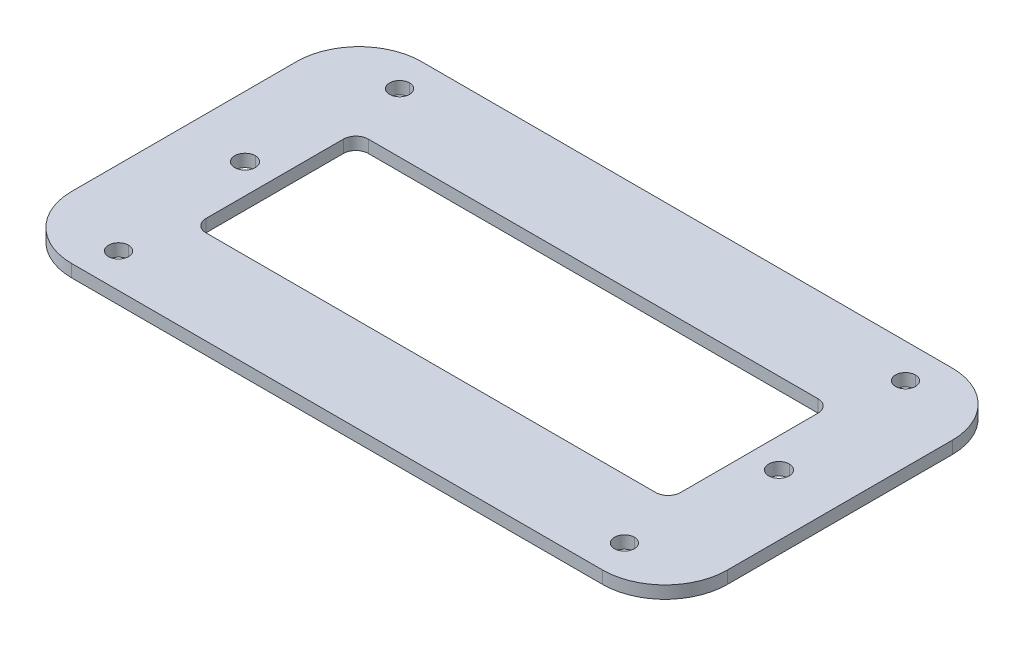
ISO-10303-21;
HEADER;
FILE_DESCRIPTION(('STEP AP214'),'2;1');
FILE_NAME('part.step','',(''),(''),'','','');
FILE_SCHEMA(('AUTOMOTIVE_DESIGN { 1 0 10303 214 1 1 1 1 }'));
ENDSEC;
DATA;
#1=APPLICATION_CONTEXT('core data for automotive mechanical design processes');
#2=APPLICATION_PROTOCOL_DEFINITION('international standard','automotive_design',2000,#1);
#3=PRODUCT_CONTEXT('',#1,'mechanical');
#4=PRODUCT('Part','Part','',(#3));
#5=PRODUCT_RELATED_PRODUCT_CATEGORY('part','',(#4));
#6=PRODUCT_DEFINITION_FORMATION('','',#4);
#7=PRODUCT_DEFINITION_CONTEXT('part definition',#1,'design');
#8=PRODUCT_DEFINITION('design','',#6,#7);
#9=PRODUCT_DEFINITION_SHAPE('','',#8);
#10=(LENGTH_UNIT() NAMED_UNIT(*) SI_UNIT(.MILLI.,.METRE.));
#11=(NAMED_UNIT(*) PLANE_ANGLE_UNIT() SI_UNIT($,.RADIAN.));
#12=(NAMED_UNIT(*) SI_UNIT($,.STERADIAN.) SOLID_ANGLE_UNIT());
#13=UNCERTAINTY_MEASURE_WITH_UNIT(LENGTH_MEASURE(1.E-05),#10,'distance_accuracy_value','');
#14=(GEOMETRIC_REPRESENTATION_CONTEXT(3) GLOBAL_UNCERTAINTY_ASSIGNED_CONTEXT((#13)) GLOBAL_UNIT_ASSIGNED_CONTEXT((#10,
#11,#12)) REPRESENTATION_CONTEXT('',''));
#15=CARTESIAN_POINT('',(0.,0.,0.));
#16=DIRECTION('',(0.,0.,1.));
#17=DIRECTION('',(1.,0.,0.));
#18=AXIS2_PLACEMENT_3D('',#15,#16,#17);
#19=CARTESIAN_POINT('',(-42.5,2.,18.));
#20=DIRECTION('',(0.,-1.,0.));
#21=DIRECTION('',(0.,0.,-1.));
#22=AXIS2_PLACEMENT_3D('',#19,#20,#21);
#23=CYLINDRICAL_SURFACE('',#22,10.);
#24=CARTESIAN_POINT('',(-42.5,2.,18.));
#25=DIRECTION('',(0.,1.,0.));
#26=DIRECTION('',(0.,0.,1.));
#27=AXIS2_PLACEMENT_3D('',#24,#25,#26);
#28=CIRCLE('',#27,10.);
#29=CARTESIAN_POINT('',(-52.5,2.,18.));
#30=VERTEX_POINT('',#29);
#31=CARTESIAN_POINT('',(-42.5,2.,28.));
#32=VERTEX_POINT('',#31);
#33=EDGE_CURVE('E255',#30,#32,#28,.T.);
#34=ORIENTED_EDGE('',*,*,#33,.F.);
#35=DIRECTION('',(0.,1.,0.));
#36=VECTOR('',#35,1.);
#37=CARTESIAN_POINT('',(-52.5,2.,18.));
#38=LINE('',#37,#36);
#39=CARTESIAN_POINT('',(-52.5,0.,18.));
#40=VERTEX_POINT('',#39);
#41=EDGE_CURVE('E254',#40,#30,#38,.T.);
#42=ORIENTED_EDGE('',*,*,#41,.F.);
#43=CARTESIAN_POINT('',(-42.5,0.,18.));
#44=DIRECTION('',(0.,-1.,0.));
#45=DIRECTION('',(0.,0.,1.));
#46=AXIS2_PLACEMENT_3D('',#43,#44,#45);
#47=CIRCLE('',#46,10.);
#48=CARTESIAN_POINT('',(-42.5,0.,28.));
#49=VERTEX_POINT('',#48);
#50=EDGE_CURVE('E237',#49,#40,#47,.T.);
#51=ORIENTED_EDGE('',*,*,#50,.F.);
#52=DIRECTION('',(0.,-1.,0.));
#53=VECTOR('',#52,1.);
#54=CARTESIAN_POINT('',(-42.5,2.,28.));
#55=LINE('',#54,#53);
#56=EDGE_CURVE('E368',#32,#49,#55,.T.);
#57=ORIENTED_EDGE('',*,*,#56,.F.);
#58=EDGE_LOOP('',(#34,#42,#51,#57));
#59=FACE_BOUND('',#58,.T.);
#60=ADVANCED_FACE('F15',(#59),#23,.T.);
#61=CARTESIAN_POINT('',(-42.5,2.,-18.));
#62=DIRECTION('',(0.,-1.,0.));
#63=DIRECTION('',(0.,0.,-1.));
#64=AXIS2_PLACEMENT_3D('',#61,#62,#63);
#65=CYLINDRICAL_SURFACE('',#64,10.);
#66=CARTESIAN_POINT('',(-42.5,2.,-18.));
#67=DIRECTION('',(0.,1.,0.));
#68=DIRECTION('',(0.,0.,1.));
#69=AXIS2_PLACEMENT_3D('',#66,#67,#68);
#70=CIRCLE('',#69,10.);
#71=CARTESIAN_POINT('',(-42.5,2.,-28.));
#72=VERTEX_POINT('',#71);
#73=CARTESIAN_POINT('',(-52.5,2.,-18.));
#74=VERTEX_POINT('',#73);
#75=EDGE_CURVE('E120',#72,#74,#70,.T.);
#76=ORIENTED_EDGE('',*,*,#75,.F.);
#77=DIRECTION('',(0.,1.,0.));
#78=VECTOR('',#77,1.);
#79=CARTESIAN_POINT('',(-42.5,2.,-28.));
#80=LINE('',#79,#78);
#81=CARTESIAN_POINT('',(-42.5,0.,-28.));
#82=VERTEX_POINT('',#81);
#83=EDGE_CURVE('E328',#82,#72,#80,.T.);
#84=ORIENTED_EDGE('',*,*,#83,.F.);
#85=CARTESIAN_POINT('',(-42.5,0.,-18.));
#86=DIRECTION('',(0.,-1.,0.));
#87=DIRECTION('',(0.,0.,1.));
#88=AXIS2_PLACEMENT_3D('',#85,#86,#87);
#89=CIRCLE('',#88,10.);
#90=CARTESIAN_POINT('',(-52.5,0.,-18.));
#91=VERTEX_POINT('',#90);
#92=EDGE_CURVE('E26',#91,#82,#89,.T.);
#93=ORIENTED_EDGE('',*,*,#92,.F.);
#94=DIRECTION('',(0.,-1.,0.));
#95=VECTOR('',#94,1.);
#96=CARTESIAN_POINT('',(-52.5,2.,-18.));
#97=LINE('',#96,#95);
#98=EDGE_CURVE('E262',#74,#91,#97,.T.);
#99=ORIENTED_EDGE('',*,*,#98,.F.);
#100=EDGE_LOOP('',(#76,#84,#93,#99));
#101=FACE_BOUND('',#100,.T.);
#102=ADVANCED_FACE('F568',(#101),#65,.T.);
#103=CARTESIAN_POINT('',(42.5,2.,-18.));
#104=DIRECTION('',(0.,1.,0.));
#105=DIRECTION('',(0.,0.,1.));
#106=AXIS2_PLACEMENT_3D('',#103,#104,#105);
#107=CYLINDRICAL_SURFACE('',#106,10.);
#108=CARTESIAN_POINT('',(42.5,2.,-18.));
#109=DIRECTION('',(0.,1.,0.));
#110=DIRECTION('',(0.,0.,1.));
#111=AXIS2_PLACEMENT_3D('',#108,#109,#110);
#112=CIRCLE('',#111,10.);
#113=CARTESIAN_POINT('',(52.5,2.,-18.));
#114=VERTEX_POINT('',#113);
#115=CARTESIAN_POINT('',(42.5,2.,-28.));
#116=VERTEX_POINT('',#115);
#117=EDGE_CURVE('E108',#114,#116,#112,.T.);
#118=ORIENTED_EDGE('',*,*,#117,.F.);
#119=DIRECTION('',(0.,1.,0.));
#120=VECTOR('',#119,1.);
#121=CARTESIAN_POINT('',(52.5,2.,-18.));
#122=LINE('',#121,#120);
#123=CARTESIAN_POINT('',(52.5,0.,-18.));
#124=VERTEX_POINT('',#123);
#125=EDGE_CURVE('E366',#124,#114,#122,.T.);
#126=ORIENTED_EDGE('',*,*,#125,.F.);
#127=CARTESIAN_POINT('',(42.5,0.,-18.));
#128=DIRECTION('',(0.,-1.,0.));
#129=DIRECTION('',(0.,0.,1.));
#130=AXIS2_PLACEMENT_3D('',#127,#128,#129);
#131=CIRCLE('',#130,10.);
#132=CARTESIAN_POINT('',(42.5,0.,-28.));
#133=VERTEX_POINT('',#132);
#134=EDGE_CURVE('E10',#133,#124,#131,.T.);
#135=ORIENTED_EDGE('',*,*,#134,.F.);
#136=DIRECTION('',(0.,-1.,0.));
#137=VECTOR('',#136,1.);
#138=CARTESIAN_POINT('',(42.5,0.,-28.));
#139=LINE('',#138,#137);
#140=EDGE_CURVE('E345',#116,#133,#139,.T.);
#141=ORIENTED_EDGE('',*,*,#140,.F.);
#142=EDGE_LOOP('',(#118,#126,#135,#141));
#143=FACE_BOUND('',#142,.T.);
#144=ADVANCED_FACE('F573',(#143),#107,.T.);
#145=CARTESIAN_POINT('',(42.5,2.,18.));
#146=DIRECTION('',(0.,1.,0.));
#147=DIRECTION('',(0.,0.,1.));
#148=AXIS2_PLACEMENT_3D('',#145,#146,#147);
#149=CYLINDRICAL_SURFACE('',#148,10.);
#150=CARTESIAN_POINT('',(42.5,2.,18.));
#151=DIRECTION('',(0.,1.,0.));
#152=DIRECTION('',(0.,0.,1.));
#153=AXIS2_PLACEMENT_3D('',#150,#151,#152);
#154=CIRCLE('',#153,10.);
#155=CARTESIAN_POINT('',(42.5,2.,28.));
#156=VERTEX_POINT('',#155);
#157=CARTESIAN_POINT('',(52.5,2.,18.));
#158=VERTEX_POINT('',#157);
#159=EDGE_CURVE('E336',#156,#158,#154,.T.);
#160=ORIENTED_EDGE('',*,*,#159,.F.);
#161=DIRECTION('',(0.,1.,0.));
#162=VECTOR('',#161,1.);
#163=CARTESIAN_POINT('',(42.5,2.,28.));
#164=LINE('',#163,#162);
#165=CARTESIAN_POINT('',(42.5,0.,28.));
#166=VERTEX_POINT('',#165);
#167=EDGE_CURVE('E418',#166,#156,#164,.T.);
#168=ORIENTED_EDGE('',*,*,#167,.F.);
#169=CARTESIAN_POINT('',(42.5,0.,18.));
#170=DIRECTION('',(0.,-1.,0.));
#171=DIRECTION('',(0.,0.,1.));
#172=AXIS2_PLACEMENT_3D('',#169,#170,#171);
#173=CIRCLE('',#172,10.);
#174=CARTESIAN_POINT('',(52.5,0.,18.));
#175=VERTEX_POINT('',#174);
#176=EDGE_CURVE('E251',#175,#166,#173,.T.);
#177=ORIENTED_EDGE('',*,*,#176,.F.);
#178=DIRECTION('',(0.,-1.,0.));
#179=VECTOR('',#178,1.);
#180=CARTESIAN_POINT('',(52.5,0.,18.));
#181=LINE('',#180,#179);
#182=EDGE_CURVE('E367',#158,#175,#181,.T.);
#183=ORIENTED_EDGE('',*,*,#182,.F.);
#184=EDGE_LOOP('',(#160,#168,#177,#183));
#185=FACE_BOUND('',#184,.T.);
#186=ADVANCED_FACE('F591',(#185),#149,.T.);
#187=CARTESIAN_POINT('',(0.,0.,0.));
#188=DIRECTION('',(0.,1.,0.));
#189=DIRECTION('',(1.,0.,0.));
#190=AXIS2_PLACEMENT_3D('',#187,#188,#189);
#191=PLANE('',#190);
#192=CARTESIAN_POINT('',(-42.75,0.,0.));
#193=DIRECTION('',(0.,1.,0.));
#194=DIRECTION('',(0.,0.,1.));
#195=AXIS2_PLACEMENT_3D('',#192,#193,#194);
#196=CIRCLE('',#195,1.65);
#197=CARTESIAN_POINT('',(-42.75,0.,-1.65));
#198=VERTEX_POINT('',#197);
#199=CARTESIAN_POINT('',(-42.75,0.,1.65));
#200=VERTEX_POINT('',#199);
#201=EDGE_CURVE('E349',#198,#200,#196,.T.);
#202=ORIENTED_EDGE('',*,*,#201,.T.);
#203=CARTESIAN_POINT('',(-42.75,0.,0.));
#204=DIRECTION('',(0.,1.,0.));
#205=DIRECTION('',(0.,0.,1.));
#206=AXIS2_PLACEMENT_3D('',#203,#204,#205);
#207=CIRCLE('',#206,1.65);
#208=EDGE_CURVE('E327',#200,#198,#207,.T.);
#209=ORIENTED_EDGE('',*,*,#208,.T.);
#210=EDGE_LOOP('',(#202,#209));
#211=FACE_BOUND('',#210,.T.);
#212=CARTESIAN_POINT('',(42.75,0.,0.));
#213=DIRECTION('',(0.,1.,0.));
#214=DIRECTION('',(0.,0.,1.));
#215=AXIS2_PLACEMENT_3D('',#212,#213,#214);
#216=CIRCLE('',#215,1.65);
#217=CARTESIAN_POINT('',(42.75,0.,-1.65));
#218=VERTEX_POINT('',#217);
#219=CARTESIAN_POINT('',(42.75,0.,1.65));
#220=VERTEX_POINT('',#219);
#221=EDGE_CURVE('E417',#218,#220,#216,.T.);
#222=ORIENTED_EDGE('',*,*,#221,.T.);
#223=CARTESIAN_POINT('',(42.75,0.,0.));
#224=DIRECTION('',(0.,1.,0.));
#225=DIRECTION('',(0.,0.,1.));
#226=AXIS2_PLACEMENT_3D('',#223,#224,#225);
#227=CIRCLE('',#226,1.65);
#228=EDGE_CURVE('E465',#220,#218,#227,.T.);
#229=ORIENTED_EDGE('',*,*,#228,.T.);
#230=EDGE_LOOP('',(#222,#229));
#231=FACE_BOUND('',#230,.T.);
#232=CARTESIAN_POINT('',(-40.5,0.,-22.5));
#233=DIRECTION('',(0.,1.,0.));
#234=DIRECTION('',(0.,0.,1.));
#235=AXIS2_PLACEMENT_3D('',#232,#233,#234);
#236=CIRCLE('',#235,1.6);
#237=CARTESIAN_POINT('',(-40.5,0.,-24.1));
#238=VERTEX_POINT('',#237);
#239=CARTESIAN_POINT('',(-40.5,0.,-20.9));
#240=VERTEX_POINT('',#239);
#241=EDGE_CURVE('E397',#238,#240,#236,.T.);
#242=ORIENTED_EDGE('',*,*,#241,.T.);
#243=CARTESIAN_POINT('',(-40.5,0.,-22.5));
#244=DIRECTION('',(0.,1.,0.));
#245=DIRECTION('',(0.,0.,1.));
#246=AXIS2_PLACEMENT_3D('',#243,#244,#245);
#247=CIRCLE('',#246,1.6);
#248=EDGE_CURVE('E280',#240,#238,#247,.T.);
#249=ORIENTED_EDGE('',*,*,#248,.T.);
#250=EDGE_LOOP('',(#242,#249));
#251=FACE_BOUND('',#250,.T.);
#252=CARTESIAN_POINT('',(-36.,0.,-11.));
#253=DIRECTION('',(0.,1.,0.));
#254=DIRECTION('',(0.,0.,1.));
#255=AXIS2_PLACEMENT_3D('',#252,#253,#254);
#256=CIRCLE('',#255,2.);
#257=CARTESIAN_POINT('',(-36.,0.,-13.));
#258=VERTEX_POINT('',#257);
#259=CARTESIAN_POINT('',(-38.,0.,-11.));
#260=VERTEX_POINT('',#259);
#261=EDGE_CURVE('E381',#258,#260,#256,.T.);
#262=ORIENTED_EDGE('',*,*,#261,.T.);
#263=DIRECTION('',(0.,0.,1.));
#264=VECTOR('',#263,1.);
#265=CARTESIAN_POINT('',(-38.,0.,0.));
#266=LINE('',#265,#264);
#267=CARTESIAN_POINT('',(-38.,0.,11.));
#268=VERTEX_POINT('',#267);
#269=EDGE_CURVE('E283',#260,#268,#266,.T.);
#270=ORIENTED_EDGE('',*,*,#269,.T.);
#271=CARTESIAN_POINT('',(-36.,0.,11.));
#272=DIRECTION('',(0.,1.,0.));
#273=DIRECTION('',(0.,0.,1.));
#274=AXIS2_PLACEMENT_3D('',#271,#272,#273);
#275=CIRCLE('',#274,2.);
#276=CARTESIAN_POINT('',(-36.,0.,13.));
#277=VERTEX_POINT('',#276);
#278=EDGE_CURVE('E438',#268,#277,#275,.T.);
#279=ORIENTED_EDGE('',*,*,#278,.T.);
#280=DIRECTION('',(1.,0.,0.));
#281=VECTOR('',#280,1.);
#282=CARTESIAN_POINT('',(0.,0.,13.));
#283=LINE('',#282,#281);
#284=CARTESIAN_POINT('',(36.,0.,13.));
#285=VERTEX_POINT('',#284);
#286=EDGE_CURVE('E387',#277,#285,#283,.T.);
#287=ORIENTED_EDGE('',*,*,#286,.T.);
#288=CARTESIAN_POINT('',(36.,0.,11.));
#289=DIRECTION('',(0.,1.,0.));
#290=DIRECTION('',(0.,0.,1.));
#291=AXIS2_PLACEMENT_3D('',#288,#289,#290);
#292=CIRCLE('',#291,2.);
#293=CARTESIAN_POINT('',(38.,0.,11.));
#294=VERTEX_POINT('',#293);
#295=EDGE_CURVE('E422',#285,#294,#292,.T.);
#296=ORIENTED_EDGE('',*,*,#295,.T.);
#297=DIRECTION('',(0.,0.,-1.));
#298=VECTOR('',#297,1.);
#299=CARTESIAN_POINT('',(38.,0.,0.));
#300=LINE('',#299,#298);
#301=CARTESIAN_POINT('',(38.,0.,-11.));
#302=VERTEX_POINT('',#301);
#303=EDGE_CURVE('E402',#294,#302,#300,.T.);
#304=ORIENTED_EDGE('',*,*,#303,.T.);
#305=CARTESIAN_POINT('',(36.,0.,-11.));
#306=DIRECTION('',(0.,1.,0.));
#307=DIRECTION('',(0.,0.,1.));
#308=AXIS2_PLACEMENT_3D('',#305,#306,#307);
#309=CIRCLE('',#308,2.);
#310=CARTESIAN_POINT('',(36.,0.,-13.));
#311=VERTEX_POINT('',#310);
#312=EDGE_CURVE('E289',#302,#311,#309,.T.);
#313=ORIENTED_EDGE('',*,*,#312,.T.);
#314=DIRECTION('',(-1.,0.,0.));
#315=VECTOR('',#314,1.);
#316=CARTESIAN_POINT('',(0.,0.,-13.));
#317=LINE('',#316,#315);
#318=EDGE_CURVE('E481',#311,#258,#317,.T.);
#319=ORIENTED_EDGE('',*,*,#318,.T.);
#320=EDGE_LOOP('',(#262,#270,#279,#287,#296,#304,#313,#319));
#321=FACE_BOUND('',#320,.T.);
#322=CARTESIAN_POINT('',(-40.5,0.,22.5));
#323=DIRECTION('',(0.,1.,0.));
#324=DIRECTION('',(0.,0.,1.));
#325=AXIS2_PLACEMENT_3D('',#322,#323,#324);
#326=CIRCLE('',#325,1.6);
#327=CARTESIAN_POINT('',(-40.5,0.,20.9));
#328=VERTEX_POINT('',#327);
#329=CARTESIAN_POINT('',(-40.5,0.,24.1));
#330=VERTEX_POINT('',#329);
#331=EDGE_CURVE('E293',#328,#330,#326,.T.);
#332=ORIENTED_EDGE('',*,*,#331,.T.);
#333=CARTESIAN_POINT('',(-40.5,0.,22.5));
#334=DIRECTION('',(0.,1.,0.));
#335=DIRECTION('',(0.,0.,1.));
#336=AXIS2_PLACEMENT_3D('',#333,#334,#335);
#337=CIRCLE('',#336,1.6);
#338=EDGE_CURVE('E432',#330,#328,#337,.T.);
#339=ORIENTED_EDGE('',*,*,#338,.T.);
#340=EDGE_LOOP('',(#332,#339));
#341=FACE_BOUND('',#340,.T.);
#342=CARTESIAN_POINT('',(40.5,0.,-22.5));
#343=DIRECTION('',(0.,1.,0.));
#344=DIRECTION('',(0.,0.,1.));
#345=AXIS2_PLACEMENT_3D('',#342,#343,#344);
#346=CIRCLE('',#345,1.6);
#347=CARTESIAN_POINT('',(40.5,0.,-24.1));
#348=VERTEX_POINT('',#347);
#349=CARTESIAN_POINT('',(40.5,0.,-20.9));
#350=VERTEX_POINT('',#349);
#351=EDGE_CURVE('E312',#348,#350,#346,.T.);
#352=ORIENTED_EDGE('',*,*,#351,.T.);
#353=CARTESIAN_POINT('',(40.5,0.,-22.5));
#354=DIRECTION('',(0.,1.,0.));
#355=DIRECTION('',(0.,0.,1.));
#356=AXIS2_PLACEMENT_3D('',#353,#354,#355);
#357=CIRCLE('',#356,1.6);
#358=EDGE_CURVE('E431',#350,#348,#357,.T.);
#359=ORIENTED_EDGE('',*,*,#358,.T.);
#360=EDGE_LOOP('',(#352,#359));
#361=FACE_BOUND('',#360,.T.);
#362=CARTESIAN_POINT('',(40.5,0.,22.5));
#363=DIRECTION('',(0.,1.,0.));
#364=DIRECTION('',(0.,0.,1.));
#365=AXIS2_PLACEMENT_3D('',#362,#363,#364);
#366=CIRCLE('',#365,1.6);
#367=CARTESIAN_POINT('',(40.5,0.,20.9));
#368=VERTEX_POINT('',#367);
#369=CARTESIAN_POINT('',(40.5,0.,24.1));
#370=VERTEX_POINT('',#369);
#371=EDGE_CURVE('E322',#368,#370,#366,.T.);
#372=ORIENTED_EDGE('',*,*,#371,.T.);
#373=CARTESIAN_POINT('',(40.5,0.,22.5));
#374=DIRECTION('',(0.,1.,0.));
#375=DIRECTION('',(0.,0.,1.));
#376=AXIS2_PLACEMENT_3D('',#373,#374,#375);
#377=CIRCLE('',#376,1.6);
#378=EDGE_CURVE('E275',#370,#368,#377,.T.);
#379=ORIENTED_EDGE('',*,*,#378,.T.);
#380=EDGE_LOOP('',(#372,#379));
#381=FACE_BOUND('',#380,.T.);
#382=DIRECTION('',(0.,0.,1.));
#383=VECTOR('',#382,1.);
#384=CARTESIAN_POINT('',(52.5,0.,0.));
#385=LINE('',#384,#383);
#386=EDGE_CURVE('E363',#124,#175,#385,.T.);
#387=ORIENTED_EDGE('',*,*,#386,.T.);
#388=ORIENTED_EDGE('',*,*,#176,.T.);
#389=DIRECTION('',(1.,0.,0.));
#390=VECTOR('',#389,1.);
#391=CARTESIAN_POINT('',(0.,0.,28.));
#392=LINE('',#391,#390);
#393=EDGE_CURVE('E246',#49,#166,#392,.T.);
#394=ORIENTED_EDGE('',*,*,#393,.F.);
#395=ORIENTED_EDGE('',*,*,#50,.T.);
#396=DIRECTION('',(0.,0.,1.));
#397=VECTOR('',#396,1.);
#398=CARTESIAN_POINT('',(-52.5,0.,0.));
#399=LINE('',#398,#397);
#400=EDGE_CURVE('E242',#91,#40,#399,.T.);
#401=ORIENTED_EDGE('',*,*,#400,.F.);
#402=ORIENTED_EDGE('',*,*,#92,.T.);
#403=DIRECTION('',(-1.,0.,0.));
#404=VECTOR('',#403,1.);
#405=CARTESIAN_POINT('',(0.,0.,-28.));
#406=LINE('',#405,#404);
#407=EDGE_CURVE('E338',#133,#82,#406,.T.);
#408=ORIENTED_EDGE('',*,*,#407,.F.);
#409=ORIENTED_EDGE('',*,*,#134,.T.);
#410=EDGE_LOOP('',(#387,#388,#394,#395,#401,#402,#408,#409));
#411=FACE_BOUND('',#410,.T.);
#412=ADVANCED_FACE('F240',(#211,#231,#251,#321,#341,#361,#381,#411),#191,.F.);
#413=CARTESIAN_POINT('',(0.,2.,0.));
#414=DIRECTION('',(0.,1.,0.));
#415=DIRECTION('',(1.,0.,0.));
#416=AXIS2_PLACEMENT_3D('',#413,#414,#415);
#417=PLANE('',#416);
#418=CARTESIAN_POINT('',(-42.75,2.,0.));
#419=DIRECTION('',(0.,1.,0.));
#420=DIRECTION('',(0.,0.,1.));
#421=AXIS2_PLACEMENT_3D('',#418,#419,#420);
#422=CIRCLE('',#421,1.65);
#423=CARTESIAN_POINT('',(-42.75,2.,-1.65));
#424=VERTEX_POINT('',#423);
#425=CARTESIAN_POINT('',(-42.75,2.,1.65));
#426=VERTEX_POINT('',#425);
#427=EDGE_CURVE('E451',#424,#426,#422,.T.);
#428=ORIENTED_EDGE('',*,*,#427,.F.);
#429=CARTESIAN_POINT('',(-42.75,2.,0.));
#430=DIRECTION('',(0.,1.,0.));
#431=DIRECTION('',(0.,0.,1.));
#432=AXIS2_PLACEMENT_3D('',#429,#430,#431);
#433=CIRCLE('',#432,1.65);
#434=EDGE_CURVE('E324',#426,#424,#433,.T.);
#435=ORIENTED_EDGE('',*,*,#434,.F.);
#436=EDGE_LOOP('',(#428,#435));
#437=FACE_BOUND('',#436,.T.);
#438=CARTESIAN_POINT('',(42.75,2.,0.));
#439=DIRECTION('',(0.,1.,0.));
#440=DIRECTION('',(0.,0.,1.));
#441=AXIS2_PLACEMENT_3D('',#438,#439,#440);
#442=CIRCLE('',#441,1.65);
#443=CARTESIAN_POINT('',(42.75,2.,-1.65));
#444=VERTEX_POINT('',#443);
#445=CARTESIAN_POINT('',(42.75,2.,1.65));
#446=VERTEX_POINT('',#445);
#447=EDGE_CURVE('E351',#444,#446,#442,.T.);
#448=ORIENTED_EDGE('',*,*,#447,.F.);
#449=CARTESIAN_POINT('',(42.75,2.,0.));
#450=DIRECTION('',(0.,1.,0.));
#451=DIRECTION('',(0.,0.,1.));
#452=AXIS2_PLACEMENT_3D('',#449,#450,#451);
#453=CIRCLE('',#452,1.65);
#454=EDGE_CURVE('E498',#446,#444,#453,.T.);
#455=ORIENTED_EDGE('',*,*,#454,.F.);
#456=EDGE_LOOP('',(#448,#455));
#457=FACE_BOUND('',#456,.T.);
#458=CARTESIAN_POINT('',(-40.5,2.,-22.5));
#459=DIRECTION('',(0.,1.,0.));
#460=DIRECTION('',(0.,0.,1.));
#461=AXIS2_PLACEMENT_3D('',#458,#459,#460);
#462=CIRCLE('',#461,1.6);
#463=CARTESIAN_POINT('',(-40.5,2.,-24.1));
#464=VERTEX_POINT('',#463);
#465=CARTESIAN_POINT('',(-40.5,2.,-20.9));
#466=VERTEX_POINT('',#465);
#467=EDGE_CURVE('E413',#464,#466,#462,.T.);
#468=ORIENTED_EDGE('',*,*,#467,.F.);
#469=CARTESIAN_POINT('',(-40.5,2.,-22.5));
#470=DIRECTION('',(0.,1.,0.));
#471=DIRECTION('',(0.,0.,1.));
#472=AXIS2_PLACEMENT_3D('',#469,#470,#471);
#473=CIRCLE('',#472,1.6);
#474=EDGE_CURVE('E284',#466,#464,#473,.T.);
#475=ORIENTED_EDGE('',*,*,#474,.F.);
#476=EDGE_LOOP('',(#468,#475));
#477=FACE_BOUND('',#476,.T.);
#478=CARTESIAN_POINT('',(-36.,2.,-11.));
#479=DIRECTION('',(0.,1.,0.));
#480=DIRECTION('',(0.,0.,1.));
#481=AXIS2_PLACEMENT_3D('',#478,#479,#480);
#482=CIRCLE('',#481,2.);
#483=CARTESIAN_POINT('',(-36.,2.,-13.));
#484=VERTEX_POINT('',#483);
#485=CARTESIAN_POINT('',(-38.,2.,-11.));
#486=VERTEX_POINT('',#485);
#487=EDGE_CURVE('E380',#484,#486,#482,.T.);
#488=ORIENTED_EDGE('',*,*,#487,.F.);
#489=DIRECTION('',(-1.,0.,0.));
#490=VECTOR('',#489,1.);
#491=CARTESIAN_POINT('',(0.,2.,-13.));
#492=LINE('',#491,#490);
#493=CARTESIAN_POINT('',(36.,2.,-13.));
#494=VERTEX_POINT('',#493);
#495=EDGE_CURVE('E459',#494,#484,#492,.T.);
#496=ORIENTED_EDGE('',*,*,#495,.F.);
#497=CARTESIAN_POINT('',(36.,2.,-11.));
#498=DIRECTION('',(0.,1.,0.));
#499=DIRECTION('',(0.,0.,1.));
#500=AXIS2_PLACEMENT_3D('',#497,#498,#499);
#501=CIRCLE('',#500,2.);
#502=CARTESIAN_POINT('',(38.,2.,-11.));
#503=VERTEX_POINT('',#502);
#504=EDGE_CURVE('E288',#503,#494,#501,.T.);
#505=ORIENTED_EDGE('',*,*,#504,.F.);
#506=DIRECTION('',(0.,0.,-1.));
#507=VECTOR('',#506,1.);
#508=CARTESIAN_POINT('',(38.,2.,0.));
#509=LINE('',#508,#507);
#510=CARTESIAN_POINT('',(38.,2.,11.));
#511=VERTEX_POINT('',#510);
#512=EDGE_CURVE('E426',#511,#503,#509,.T.);
#513=ORIENTED_EDGE('',*,*,#512,.F.);
#514=CARTESIAN_POINT('',(36.,2.,11.));
#515=DIRECTION('',(0.,1.,0.));
#516=DIRECTION('',(0.,0.,1.));
#517=AXIS2_PLACEMENT_3D('',#514,#515,#516);
#518=CIRCLE('',#517,2.);
#519=CARTESIAN_POINT('',(36.,2.,13.));
#520=VERTEX_POINT('',#519);
#521=EDGE_CURVE('E392',#520,#511,#518,.T.);
#522=ORIENTED_EDGE('',*,*,#521,.F.);
#523=DIRECTION('',(1.,0.,0.));
#524=VECTOR('',#523,1.);
#525=CARTESIAN_POINT('',(0.,2.,13.));
#526=LINE('',#525,#524);
#527=CARTESIAN_POINT('',(-36.,2.,13.));
#528=VERTEX_POINT('',#527);
#529=EDGE_CURVE('E435',#528,#520,#526,.T.);
#530=ORIENTED_EDGE('',*,*,#529,.F.);
#531=CARTESIAN_POINT('',(-36.,2.,11.));
#532=DIRECTION('',(0.,1.,0.));
#533=DIRECTION('',(0.,0.,1.));
#534=AXIS2_PLACEMENT_3D('',#531,#532,#533);
#535=CIRCLE('',#534,2.);
#536=CARTESIAN_POINT('',(-38.,2.,11.));
#537=VERTEX_POINT('',#536);
#538=EDGE_CURVE('E359',#537,#528,#535,.T.);
#539=ORIENTED_EDGE('',*,*,#538,.F.);
#540=DIRECTION('',(0.,0.,1.));
#541=VECTOR('',#540,1.);
#542=CARTESIAN_POINT('',(-38.,2.,0.));
#543=LINE('',#542,#541);
#544=EDGE_CURVE('E318',#486,#537,#543,.T.);
#545=ORIENTED_EDGE('',*,*,#544,.F.);
#546=EDGE_LOOP('',(#488,#496,#505,#513,#522,#530,#539,#545));
#547=FACE_BOUND('',#546,.T.);
#548=CARTESIAN_POINT('',(-40.5,2.,22.5));
#549=DIRECTION('',(0.,1.,0.));
#550=DIRECTION('',(0.,0.,1.));
#551=AXIS2_PLACEMENT_3D('',#548,#549,#550);
#552=CIRCLE('',#551,1.6);
#553=CARTESIAN_POINT('',(-40.5,2.,20.9));
#554=VERTEX_POINT('',#553);
#555=CARTESIAN_POINT('',(-40.5,2.,24.1));
#556=VERTEX_POINT('',#555);
#557=EDGE_CURVE('E294',#554,#556,#552,.T.);
#558=ORIENTED_EDGE('',*,*,#557,.F.);
#559=CARTESIAN_POINT('',(-40.5,2.,22.5));
#560=DIRECTION('',(0.,1.,0.));
#561=DIRECTION('',(0.,0.,1.));
#562=AXIS2_PLACEMENT_3D('',#559,#560,#561);
#563=CIRCLE('',#562,1.6);
#564=EDGE_CURVE('E485',#556,#554,#563,.T.);
#565=ORIENTED_EDGE('',*,*,#564,.F.);
#566=EDGE_LOOP('',(#558,#565));
#567=FACE_BOUND('',#566,.T.);
#568=CARTESIAN_POINT('',(40.5,2.,-22.5));
#569=DIRECTION('',(0.,1.,0.));
#570=DIRECTION('',(0.,0.,1.));
#571=AXIS2_PLACEMENT_3D('',#568,#569,#570);
#572=CIRCLE('',#571,1.6);
#573=CARTESIAN_POINT('',(40.5,2.,-24.1));
#574=VERTEX_POINT('',#573);
#575=CARTESIAN_POINT('',(40.5,2.,-20.9));
#576=VERTEX_POINT('',#575);
#577=EDGE_CURVE('E409',#574,#576,#572,.T.);
#578=ORIENTED_EDGE('',*,*,#577,.F.);
#579=CARTESIAN_POINT('',(40.5,2.,-22.5));
#580=DIRECTION('',(0.,1.,0.));
#581=DIRECTION('',(0.,0.,1.));
#582=AXIS2_PLACEMENT_3D('',#579,#580,#581);
#583=CIRCLE('',#582,1.6);
#584=EDGE_CURVE('E428',#576,#574,#583,.T.);
#585=ORIENTED_EDGE('',*,*,#584,.F.);
#586=EDGE_LOOP('',(#578,#585));
#587=FACE_BOUND('',#586,.T.);
#588=CARTESIAN_POINT('',(40.5,2.,22.5));
#589=DIRECTION('',(0.,1.,0.));
#590=DIRECTION('',(0.,0.,1.));
#591=AXIS2_PLACEMENT_3D('',#588,#589,#590);
#592=CIRCLE('',#591,1.6);
#593=CARTESIAN_POINT('',(40.5,2.,20.9));
#594=VERTEX_POINT('',#593);
#595=CARTESIAN_POINT('',(40.5,2.,24.1));
#596=VERTEX_POINT('',#595);
#597=EDGE_CURVE('E323',#594,#596,#592,.T.);
#598=ORIENTED_EDGE('',*,*,#597,.F.);
#599=CARTESIAN_POINT('',(40.5,2.,22.5));
#600=DIRECTION('',(0.,1.,0.));
#601=DIRECTION('',(0.,0.,1.));
#602=AXIS2_PLACEMENT_3D('',#599,#600,#601);
#603=CIRCLE('',#602,1.6);
#604=EDGE_CURVE('E279',#596,#594,#603,.T.);
#605=ORIENTED_EDGE('',*,*,#604,.F.);
#606=EDGE_LOOP('',(#598,#605));
#607=FACE_BOUND('',#606,.T.);
#608=DIRECTION('',(1.,0.,0.));
#609=VECTOR('',#608,1.);
#610=CARTESIAN_POINT('',(0.,2.,28.));
#611=LINE('',#610,#609);
#612=EDGE_CURVE('E372',#32,#156,#611,.T.);
#613=ORIENTED_EDGE('',*,*,#612,.T.);
#614=ORIENTED_EDGE('',*,*,#159,.T.);
#615=DIRECTION('',(0.,0.,1.));
#616=VECTOR('',#615,1.);
#617=CARTESIAN_POINT('',(52.5,2.,0.));
#618=LINE('',#617,#616);
#619=EDGE_CURVE('E371',#114,#158,#618,.T.);
#620=ORIENTED_EDGE('',*,*,#619,.F.);
#621=ORIENTED_EDGE('',*,*,#117,.T.);
#622=DIRECTION('',(-1.,0.,0.));
#623=VECTOR('',#622,1.);
#624=CARTESIAN_POINT('',(0.,2.,-28.));
#625=LINE('',#624,#623);
#626=EDGE_CURVE('E278',#116,#72,#625,.T.);
#627=ORIENTED_EDGE('',*,*,#626,.T.);
#628=ORIENTED_EDGE('',*,*,#75,.T.);
#629=DIRECTION('',(0.,0.,1.));
#630=VECTOR('',#629,1.);
#631=CARTESIAN_POINT('',(-52.5,2.,0.));
#632=LINE('',#631,#630);
#633=EDGE_CURVE('E268',#74,#30,#632,.T.);
#634=ORIENTED_EDGE('',*,*,#633,.T.);
#635=ORIENTED_EDGE('',*,*,#33,.T.);
#636=EDGE_LOOP('',(#613,#614,#620,#621,#627,#628,#634,#635));
#637=FACE_BOUND('',#636,.T.);
#638=ADVANCED_FACE('F590',(#437,#457,#477,#547,#567,#587,#607,#637),#417,.T.);
#639=CARTESIAN_POINT('',(-42.75,2.,0.));
#640=DIRECTION('',(0.,-1.,0.));
#641=DIRECTION('',(0.,0.,-1.));
#642=AXIS2_PLACEMENT_3D('',#639,#640,#641);
#643=CYLINDRICAL_SURFACE('',#642,1.65);
#644=DIRECTION('',(0.,-1.,0.));
#645=VECTOR('',#644,1.);
#646=CARTESIAN_POINT('',(-42.75,2.,1.65));
#647=LINE('',#646,#645);
#648=EDGE_CURVE('E455',#426,#200,#647,.T.);
#649=ORIENTED_EDGE('',*,*,#648,.F.);
#650=ORIENTED_EDGE('',*,*,#434,.T.);
#651=DIRECTION('',(0.,-1.,0.));
#652=VECTOR('',#651,1.);
#653=CARTESIAN_POINT('',(-42.75,2.,-1.65));
#654=LINE('',#653,#652);
#655=EDGE_CURVE('E376',#424,#198,#654,.T.);
#656=ORIENTED_EDGE('',*,*,#655,.T.);
#657=ORIENTED_EDGE('',*,*,#208,.F.);
#658=EDGE_LOOP('',(#649,#650,#656,#657));
#659=FACE_BOUND('',#658,.T.);
#660=ADVANCED_FACE('F577',(#659),#643,.F.);
#661=CARTESIAN_POINT('',(0.,2.,-28.));
#662=DIRECTION('',(0.,0.,1.));
#663=DIRECTION('',(1.,0.,0.));
#664=AXIS2_PLACEMENT_3D('',#661,#662,#663);
#665=PLANE('',#664);
#666=ORIENTED_EDGE('',*,*,#626,.F.);
#667=ORIENTED_EDGE('',*,*,#140,.T.);
#668=ORIENTED_EDGE('',*,*,#407,.T.);
#669=ORIENTED_EDGE('',*,*,#83,.T.);
#670=EDGE_LOOP('',(#666,#667,#668,#669));
#671=FACE_BOUND('',#670,.T.);
#672=ADVANCED_FACE('F634',(#671),#665,.F.);
#673=CARTESIAN_POINT('',(40.5,2.,22.5));
#674=DIRECTION('',(0.,-1.,0.));
#675=DIRECTION('',(0.,0.,-1.));
#676=AXIS2_PLACEMENT_3D('',#673,#674,#675);
#677=CYLINDRICAL_SURFACE('',#676,1.6);
#678=DIRECTION('',(0.,-1.,0.));
#679=VECTOR('',#678,1.);
#680=CARTESIAN_POINT('',(40.5,2.,24.1));
#681=LINE('',#680,#679);
#682=EDGE_CURVE('E319',#596,#370,#681,.T.);
#683=ORIENTED_EDGE('',*,*,#682,.F.);
#684=ORIENTED_EDGE('',*,*,#604,.T.);
#685=DIRECTION('',(0.,-1.,0.));
#686=VECTOR('',#685,1.);
#687=CARTESIAN_POINT('',(40.5,2.,20.9));
#688=LINE('',#687,#686);
#689=EDGE_CURVE('E396',#594,#368,#688,.T.);
#690=ORIENTED_EDGE('',*,*,#689,.T.);
#691=ORIENTED_EDGE('',*,*,#378,.F.);
#692=EDGE_LOOP('',(#683,#684,#690,#691));
#693=FACE_BOUND('',#692,.T.);
#694=ADVANCED_FACE('F636',(#693),#677,.F.);
#695=CARTESIAN_POINT('',(40.5,2.,-22.5));
#696=DIRECTION('',(0.,-1.,0.));
#697=DIRECTION('',(0.,0.,-1.));
#698=AXIS2_PLACEMENT_3D('',#695,#696,#697);
#699=CYLINDRICAL_SURFACE('',#698,1.6);
#700=DIRECTION('',(0.,-1.,0.));
#701=VECTOR('',#700,1.);
#702=CARTESIAN_POINT('',(40.5,2.,-20.9));
#703=LINE('',#702,#701);
#704=EDGE_CURVE('E471',#576,#350,#703,.T.);
#705=ORIENTED_EDGE('',*,*,#704,.F.);
#706=ORIENTED_EDGE('',*,*,#584,.T.);
#707=DIRECTION('',(0.,-1.,0.));
#708=VECTOR('',#707,1.);
#709=CARTESIAN_POINT('',(40.5,2.,-24.1));
#710=LINE('',#709,#708);
#711=EDGE_CURVE('E305',#574,#348,#710,.T.);
#712=ORIENTED_EDGE('',*,*,#711,.T.);
#713=ORIENTED_EDGE('',*,*,#358,.F.);
#714=EDGE_LOOP('',(#705,#706,#712,#713));
#715=FACE_BOUND('',#714,.T.);
#716=ADVANCED_FACE('F611',(#715),#699,.F.);
#717=CARTESIAN_POINT('',(-40.5,2.,22.5));
#718=DIRECTION('',(0.,-1.,0.));
#719=DIRECTION('',(0.,0.,-1.));
#720=AXIS2_PLACEMENT_3D('',#717,#718,#719);
#721=CYLINDRICAL_SURFACE('',#720,1.6);
#722=DIRECTION('',(0.,-1.,0.));
#723=VECTOR('',#722,1.);
#724=CARTESIAN_POINT('',(-40.5,2.,24.1));
#725=LINE('',#724,#723);
#726=EDGE_CURVE('E290',#556,#330,#725,.T.);
#727=ORIENTED_EDGE('',*,*,#726,.F.);
#728=ORIENTED_EDGE('',*,*,#564,.T.);
#729=DIRECTION('',(0.,-1.,0.));
#730=VECTOR('',#729,1.);
#731=CARTESIAN_POINT('',(-40.5,2.,20.9));
#732=LINE('',#731,#730);
#733=EDGE_CURVE('E303',#554,#328,#732,.T.);
#734=ORIENTED_EDGE('',*,*,#733,.T.);
#735=ORIENTED_EDGE('',*,*,#338,.F.);
#736=EDGE_LOOP('',(#727,#728,#734,#735));
#737=FACE_BOUND('',#736,.T.);
#738=ADVANCED_FACE('F551',(#737),#721,.F.);
#739=CARTESIAN_POINT('',(-38.,2.,0.));
#740=DIRECTION('',(1.,0.,0.));
#741=DIRECTION('',(0.,0.,1.));
#742=AXIS2_PLACEMENT_3D('',#739,#740,#741);
#743=PLANE('',#742);
#744=ORIENTED_EDGE('',*,*,#269,.F.);
#745=DIRECTION('',(0.,-1.,0.));
#746=VECTOR('',#745,1.);
#747=CARTESIAN_POINT('',(-38.,2.,-11.));
#748=LINE('',#747,#746);
#749=EDGE_CURVE('E477',#486,#260,#748,.T.);
#750=ORIENTED_EDGE('',*,*,#749,.F.);
#751=ORIENTED_EDGE('',*,*,#544,.T.);
#752=DIRECTION('',(0.,-1.,0.));
#753=VECTOR('',#752,1.);
#754=CARTESIAN_POINT('',(-38.,2.,11.));
#755=LINE('',#754,#753);
#756=EDGE_CURVE('E19',#537,#268,#755,.T.);
#757=ORIENTED_EDGE('',*,*,#756,.T.);
#758=EDGE_LOOP('',(#744,#750,#751,#757));
#759=FACE_BOUND('',#758,.T.);
#760=ADVANCED_FACE('F599',(#759),#743,.T.);
#761=CARTESIAN_POINT('',(-40.5,2.,-22.5));
#762=DIRECTION('',(0.,-1.,0.));
#763=DIRECTION('',(0.,0.,-1.));
#764=AXIS2_PLACEMENT_3D('',#761,#762,#763);
#765=CYLINDRICAL_SURFACE('',#764,1.6);
#766=DIRECTION('',(0.,-1.,0.));
#767=VECTOR('',#766,1.);
#768=CARTESIAN_POINT('',(-40.5,2.,-20.9));
#769=LINE('',#768,#767);
#770=EDGE_CURVE('E401',#466,#240,#769,.T.);
#771=ORIENTED_EDGE('',*,*,#770,.F.);
#772=ORIENTED_EDGE('',*,*,#474,.T.);
#773=DIRECTION('',(0.,-1.,0.));
#774=VECTOR('',#773,1.);
#775=CARTESIAN_POINT('',(-40.5,2.,-24.1));
#776=LINE('',#775,#774);
#777=EDGE_CURVE('E356',#464,#238,#776,.T.);
#778=ORIENTED_EDGE('',*,*,#777,.T.);
#779=ORIENTED_EDGE('',*,*,#248,.F.);
#780=EDGE_LOOP('',(#771,#772,#778,#779));
#781=FACE_BOUND('',#780,.T.);
#782=ADVANCED_FACE('F602',(#781),#765,.F.);
#783=CARTESIAN_POINT('',(42.75,2.,0.));
#784=DIRECTION('',(0.,-1.,0.));
#785=DIRECTION('',(0.,0.,-1.));
#786=AXIS2_PLACEMENT_3D('',#783,#784,#785);
#787=CYLINDRICAL_SURFACE('',#786,1.65);
#788=DIRECTION('',(0.,-1.,0.));
#789=VECTOR('',#788,1.);
#790=CARTESIAN_POINT('',(42.75,2.,1.65));
#791=LINE('',#790,#789);
#792=EDGE_CURVE('E355',#446,#220,#791,.T.);
#793=ORIENTED_EDGE('',*,*,#792,.F.);
#794=ORIENTED_EDGE('',*,*,#454,.T.);
#795=DIRECTION('',(0.,-1.,0.));
#796=VECTOR('',#795,1.);
#797=CARTESIAN_POINT('',(42.75,2.,-1.65));
#798=LINE('',#797,#796);
#799=EDGE_CURVE('E386',#444,#218,#798,.T.);
#800=ORIENTED_EDGE('',*,*,#799,.T.);
#801=ORIENTED_EDGE('',*,*,#228,.F.);
#802=EDGE_LOOP('',(#793,#794,#800,#801));
#803=FACE_BOUND('',#802,.T.);
#804=ADVANCED_FACE('F522',(#803),#787,.F.);
#805=CARTESIAN_POINT('',(52.5,2.,0.));
#806=DIRECTION('',(1.,0.,0.));
#807=DIRECTION('',(0.,1.,0.));
#808=AXIS2_PLACEMENT_3D('',#805,#806,#807);
#809=PLANE('',#808);
#810=ORIENTED_EDGE('',*,*,#619,.T.);
#811=ORIENTED_EDGE('',*,*,#182,.T.);
#812=ORIENTED_EDGE('',*,*,#386,.F.);
#813=ORIENTED_EDGE('',*,*,#125,.T.);
#814=EDGE_LOOP('',(#810,#811,#812,#813));
#815=FACE_BOUND('',#814,.T.);
#816=ADVANCED_FACE('F632',(#815),#809,.T.);
#817=CARTESIAN_POINT('',(0.,2.,28.));
#818=DIRECTION('',(0.,0.,-1.));
#819=DIRECTION('',(0.,-1.,0.));
#820=AXIS2_PLACEMENT_3D('',#817,#818,#819);
#821=PLANE('',#820);
#822=ORIENTED_EDGE('',*,*,#393,.T.);
#823=ORIENTED_EDGE('',*,*,#167,.T.);
#824=ORIENTED_EDGE('',*,*,#612,.F.);
#825=ORIENTED_EDGE('',*,*,#56,.T.);
#826=EDGE_LOOP('',(#822,#823,#824,#825));
#827=FACE_BOUND('',#826,.T.);
#828=ADVANCED_FACE('F618',(#827),#821,.F.);
#829=CARTESIAN_POINT('',(-52.5,2.,0.));
#830=DIRECTION('',(1.,0.,0.));
#831=DIRECTION('',(0.,0.,-1.));
#832=AXIS2_PLACEMENT_3D('',#829,#830,#831);
#833=PLANE('',#832);
#834=ORIENTED_EDGE('',*,*,#633,.F.);
#835=ORIENTED_EDGE('',*,*,#98,.T.);
#836=ORIENTED_EDGE('',*,*,#400,.T.);
#837=ORIENTED_EDGE('',*,*,#41,.T.);
#838=EDGE_LOOP('',(#834,#835,#836,#837));
#839=FACE_BOUND('',#838,.T.);
#840=ADVANCED_FACE('F261',(#839),#833,.F.);
#841=CARTESIAN_POINT('',(-36.,2.,11.));
#842=DIRECTION('',(0.,-1.,0.));
#843=DIRECTION('',(0.,0.,-1.));
#844=AXIS2_PLACEMENT_3D('',#841,#842,#843);
#845=CYLINDRICAL_SURFACE('',#844,2.);
#846=ORIENTED_EDGE('',*,*,#278,.F.);
#847=ORIENTED_EDGE('',*,*,#756,.F.);
#848=ORIENTED_EDGE('',*,*,#538,.T.);
#849=DIRECTION('',(0.,-1.,0.));
#850=VECTOR('',#849,1.);
#851=CARTESIAN_POINT('',(-36.,2.,13.));
#852=LINE('',#851,#850);
#853=EDGE_CURVE('E391',#528,#277,#852,.T.);
#854=ORIENTED_EDGE('',*,*,#853,.T.);
#855=EDGE_LOOP('',(#846,#847,#848,#854));
#856=FACE_BOUND('',#855,.T.);
#857=ADVANCED_FACE('F586',(#856),#845,.F.);
#858=CARTESIAN_POINT('',(0.,2.,13.));
#859=DIRECTION('',(0.,0.,-1.));
#860=DIRECTION('',(-1.,0.,0.));
#861=AXIS2_PLACEMENT_3D('',#858,#859,#860);
#862=PLANE('',#861);
#863=ORIENTED_EDGE('',*,*,#286,.F.);
#864=ORIENTED_EDGE('',*,*,#853,.F.);
#865=ORIENTED_EDGE('',*,*,#529,.T.);
#866=DIRECTION('',(0.,-1.,0.));
#867=VECTOR('',#866,1.);
#868=CARTESIAN_POINT('',(36.,2.,13.));
#869=LINE('',#868,#867);
#870=EDGE_CURVE('E425',#520,#285,#869,.T.);
#871=ORIENTED_EDGE('',*,*,#870,.T.);
#872=EDGE_LOOP('',(#863,#864,#865,#871));
#873=FACE_BOUND('',#872,.T.);
#874=ADVANCED_FACE('F582',(#873),#862,.T.);
#875=CARTESIAN_POINT('',(36.,2.,11.));
#876=DIRECTION('',(0.,-1.,0.));
#877=DIRECTION('',(0.,0.,-1.));
#878=AXIS2_PLACEMENT_3D('',#875,#876,#877);
#879=CYLINDRICAL_SURFACE('',#878,2.);
#880=ORIENTED_EDGE('',*,*,#295,.F.);
#881=ORIENTED_EDGE('',*,*,#870,.F.);
#882=ORIENTED_EDGE('',*,*,#521,.T.);
#883=DIRECTION('',(0.,-1.,0.));
#884=VECTOR('',#883,1.);
#885=CARTESIAN_POINT('',(38.,2.,11.));
#886=LINE('',#885,#884);
#887=EDGE_CURVE('E405',#511,#294,#886,.T.);
#888=ORIENTED_EDGE('',*,*,#887,.T.);
#889=EDGE_LOOP('',(#880,#881,#882,#888));
#890=FACE_BOUND('',#889,.T.);
#891=ADVANCED_FACE('F578',(#890),#879,.F.);
#892=CARTESIAN_POINT('',(38.,2.,0.));
#893=DIRECTION('',(-1.,0.,0.));
#894=DIRECTION('',(0.,0.,1.));
#895=AXIS2_PLACEMENT_3D('',#892,#893,#894);
#896=PLANE('',#895);
#897=ORIENTED_EDGE('',*,*,#303,.F.);
#898=ORIENTED_EDGE('',*,*,#887,.F.);
#899=ORIENTED_EDGE('',*,*,#512,.T.);
#900=DIRECTION('',(0.,-1.,0.));
#901=VECTOR('',#900,1.);
#902=CARTESIAN_POINT('',(38.,2.,-11.));
#903=LINE('',#902,#901);
#904=EDGE_CURVE('E285',#503,#302,#903,.T.);
#905=ORIENTED_EDGE('',*,*,#904,.T.);
#906=EDGE_LOOP('',(#897,#898,#899,#905));
#907=FACE_BOUND('',#906,.T.);
#908=ADVANCED_FACE('F581',(#907),#896,.T.);
#909=CARTESIAN_POINT('',(36.,2.,-11.));
#910=DIRECTION('',(0.,-1.,0.));
#911=DIRECTION('',(0.,0.,-1.));
#912=AXIS2_PLACEMENT_3D('',#909,#910,#911);
#913=CYLINDRICAL_SURFACE('',#912,2.);
#914=ORIENTED_EDGE('',*,*,#312,.F.);
#915=ORIENTED_EDGE('',*,*,#904,.F.);
#916=ORIENTED_EDGE('',*,*,#504,.T.);
#917=DIRECTION('',(0.,-1.,0.));
#918=VECTOR('',#917,1.);
#919=CARTESIAN_POINT('',(36.,2.,-13.));
#920=LINE('',#919,#918);
#921=EDGE_CURVE('E462',#494,#311,#920,.T.);
#922=ORIENTED_EDGE('',*,*,#921,.T.);
#923=EDGE_LOOP('',(#914,#915,#916,#922));
#924=FACE_BOUND('',#923,.T.);
#925=ADVANCED_FACE('F597',(#924),#913,.F.);
#926=CARTESIAN_POINT('',(0.,2.,-13.));
#927=DIRECTION('',(0.,0.,1.));
#928=DIRECTION('',(1.,0.,0.));
#929=AXIS2_PLACEMENT_3D('',#926,#927,#928);
#930=PLANE('',#929);
#931=ORIENTED_EDGE('',*,*,#318,.F.);
#932=ORIENTED_EDGE('',*,*,#921,.F.);
#933=ORIENTED_EDGE('',*,*,#495,.T.);
#934=DIRECTION('',(0.,-1.,0.));
#935=VECTOR('',#934,1.);
#936=CARTESIAN_POINT('',(-36.,2.,-13.));
#937=LINE('',#936,#935);
#938=EDGE_CURVE('E377',#484,#258,#937,.T.);
#939=ORIENTED_EDGE('',*,*,#938,.T.);
#940=EDGE_LOOP('',(#931,#932,#933,#939));
#941=FACE_BOUND('',#940,.T.);
#942=ADVANCED_FACE('F593',(#941),#930,.T.);
#943=CARTESIAN_POINT('',(-36.,2.,-11.));
#944=DIRECTION('',(0.,-1.,0.));
#945=DIRECTION('',(0.,0.,-1.));
#946=AXIS2_PLACEMENT_3D('',#943,#944,#945);
#947=CYLINDRICAL_SURFACE('',#946,2.);
#948=ORIENTED_EDGE('',*,*,#261,.F.);
#949=ORIENTED_EDGE('',*,*,#938,.F.);
#950=ORIENTED_EDGE('',*,*,#487,.T.);
#951=ORIENTED_EDGE('',*,*,#749,.T.);
#952=EDGE_LOOP('',(#948,#949,#950,#951));
#953=FACE_BOUND('',#952,.T.);
#954=ADVANCED_FACE('F596',(#953),#947,.F.);
#955=CARTESIAN_POINT('',(42.75,2.,0.));
#956=DIRECTION('',(0.,-1.,0.));
#957=DIRECTION('',(0.,0.,-1.));
#958=AXIS2_PLACEMENT_3D('',#955,#956,#957);
#959=CYLINDRICAL_SURFACE('',#958,1.65);
#960=ORIENTED_EDGE('',*,*,#447,.T.);
#961=ORIENTED_EDGE('',*,*,#792,.T.);
#962=ORIENTED_EDGE('',*,*,#221,.F.);
#963=ORIENTED_EDGE('',*,*,#799,.F.);
#964=EDGE_LOOP('',(#960,#961,#962,#963));
#965=FACE_BOUND('',#964,.T.);
#966=ADVANCED_FACE('F526',(#965),#959,.F.);
#967=CARTESIAN_POINT('',(-40.5,2.,-22.5));
#968=DIRECTION('',(0.,-1.,0.));
#969=DIRECTION('',(0.,0.,-1.));
#970=AXIS2_PLACEMENT_3D('',#967,#968,#969);
#971=CYLINDRICAL_SURFACE('',#970,1.6);
#972=ORIENTED_EDGE('',*,*,#467,.T.);
#973=ORIENTED_EDGE('',*,*,#770,.T.);
#974=ORIENTED_EDGE('',*,*,#241,.F.);
#975=ORIENTED_EDGE('',*,*,#777,.F.);
#976=EDGE_LOOP('',(#972,#973,#974,#975));
#977=FACE_BOUND('',#976,.T.);
#978=ADVANCED_FACE('F17',(#977),#971,.F.);
#979=CARTESIAN_POINT('',(-40.5,2.,22.5));
#980=DIRECTION('',(0.,-1.,0.));
#981=DIRECTION('',(0.,0.,-1.));
#982=AXIS2_PLACEMENT_3D('',#979,#980,#981);
#983=CYLINDRICAL_SURFACE('',#982,1.6);
#984=ORIENTED_EDGE('',*,*,#557,.T.);
#985=ORIENTED_EDGE('',*,*,#726,.T.);
#986=ORIENTED_EDGE('',*,*,#331,.F.);
#987=ORIENTED_EDGE('',*,*,#733,.F.);
#988=EDGE_LOOP('',(#984,#985,#986,#987));
#989=FACE_BOUND('',#988,.T.);
#990=ADVANCED_FACE('F552',(#989),#983,.F.);
#991=CARTESIAN_POINT('',(40.5,2.,-22.5));
#992=DIRECTION('',(0.,-1.,0.));
#993=DIRECTION('',(0.,0.,-1.));
#994=AXIS2_PLACEMENT_3D('',#991,#992,#993);
#995=CYLINDRICAL_SURFACE('',#994,1.6);
#996=ORIENTED_EDGE('',*,*,#577,.T.);
#997=ORIENTED_EDGE('',*,*,#704,.T.);
#998=ORIENTED_EDGE('',*,*,#351,.F.);
#999=ORIENTED_EDGE('',*,*,#711,.F.);
#1000=EDGE_LOOP('',(#996,#997,#998,#999));
#1001=FACE_BOUND('',#1000,.T.);
#1002=ADVANCED_FACE('F554',(#1001),#995,.F.);
#1003=CARTESIAN_POINT('',(40.5,2.,22.5));
#1004=DIRECTION('',(0.,-1.,0.));
#1005=DIRECTION('',(0.,0.,-1.));
#1006=AXIS2_PLACEMENT_3D('',#1003,#1004,#1005);
#1007=CYLINDRICAL_SURFACE('',#1006,1.6);
#1008=ORIENTED_EDGE('',*,*,#597,.T.);
#1009=ORIENTED_EDGE('',*,*,#682,.T.);
#1010=ORIENTED_EDGE('',*,*,#371,.F.);
#1011=ORIENTED_EDGE('',*,*,#689,.F.);
#1012=EDGE_LOOP('',(#1008,#1009,#1010,#1011));
#1013=FACE_BOUND('',#1012,.T.);
#1014=ADVANCED_FACE('F561',(#1013),#1007,.F.);
#1015=CARTESIAN_POINT('',(-42.75,2.,0.));
#1016=DIRECTION('',(0.,-1.,0.));
#1017=DIRECTION('',(0.,0.,-1.));
#1018=AXIS2_PLACEMENT_3D('',#1015,#1016,#1017);
#1019=CYLINDRICAL_SURFACE('',#1018,1.65);
#1020=ORIENTED_EDGE('',*,*,#427,.T.);
#1021=ORIENTED_EDGE('',*,*,#648,.T.);
#1022=ORIENTED_EDGE('',*,*,#201,.F.);
#1023=ORIENTED_EDGE('',*,*,#655,.F.);
#1024=EDGE_LOOP('',(#1020,#1021,#1022,#1023));
#1025=FACE_BOUND('',#1024,.T.);
#1026=ADVANCED_FACE('F622',(#1025),#1019,.F.);
#1027=CLOSED_SHELL('',(#60,#102,#144,#186,#412,#638,#660,#672,#694,#716,#738,#760,#782,#804,
#816,#828,#840,#857,#874,#891,#908,#925,#942,#954,#966,#978,#990,#1002,#1014,#1026));
#1028=MANIFOLD_SOLID_BREP('B1',#1027);
#1029=ADVANCED_BREP_SHAPE_REPRESENTATION('',(#18,#1028),#14);
#1030=SHAPE_DEFINITION_REPRESENTATION(#9,#1029);
ENDSEC;
END-ISO-10303-21;
